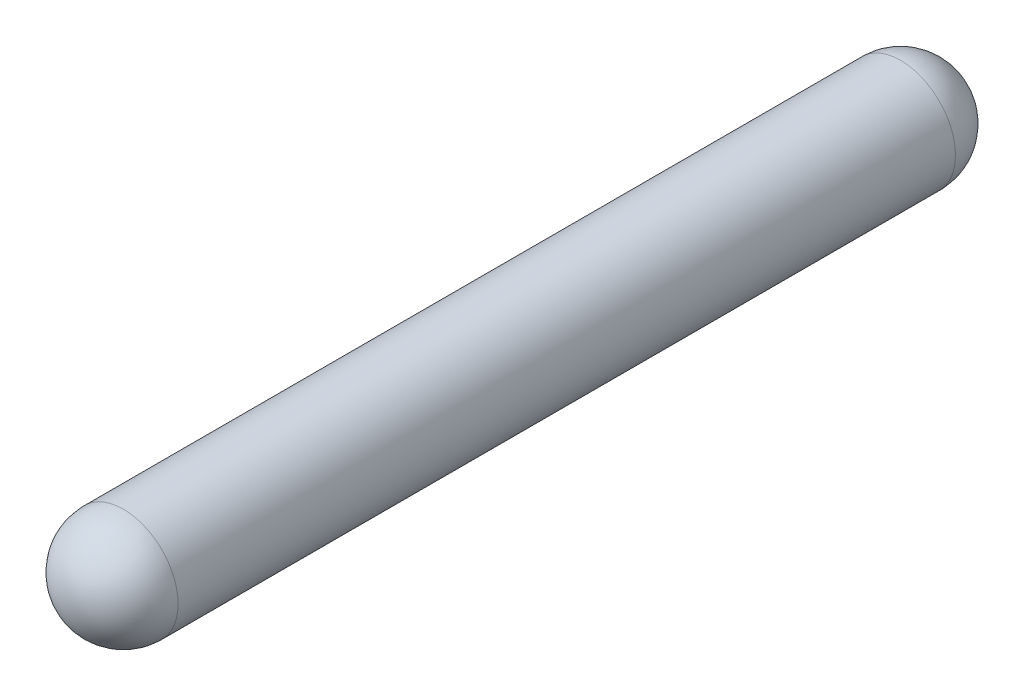
ISO-10303-21;
HEADER;
FILE_DESCRIPTION(('STEP AP214'),'2;1');
FILE_NAME('part.step','',(''),(''),'','','');
FILE_SCHEMA(('AUTOMOTIVE_DESIGN { 1 0 10303 214 1 1 1 1 }'));
ENDSEC;
DATA;
#1=APPLICATION_CONTEXT('core data for automotive mechanical design processes');
#2=APPLICATION_PROTOCOL_DEFINITION('international standard','automotive_design',2000,#1);
#3=PRODUCT_CONTEXT('',#1,'mechanical');
#4=PRODUCT('Part','Part','',(#3));
#5=PRODUCT_RELATED_PRODUCT_CATEGORY('part','',(#4));
#6=PRODUCT_DEFINITION_FORMATION('','',#4);
#7=PRODUCT_DEFINITION_CONTEXT('part definition',#1,'design');
#8=PRODUCT_DEFINITION('design','',#6,#7);
#9=PRODUCT_DEFINITION_SHAPE('','',#8);
#10=(LENGTH_UNIT() NAMED_UNIT(*) SI_UNIT(.MILLI.,.METRE.));
#11=(NAMED_UNIT(*) PLANE_ANGLE_UNIT() SI_UNIT($,.RADIAN.));
#12=(NAMED_UNIT(*) SI_UNIT($,.STERADIAN.) SOLID_ANGLE_UNIT());
#13=UNCERTAINTY_MEASURE_WITH_UNIT(LENGTH_MEASURE(1.E-05),#10,'distance_accuracy_value','');
#14=(GEOMETRIC_REPRESENTATION_CONTEXT(3) GLOBAL_UNCERTAINTY_ASSIGNED_CONTEXT((#13)) GLOBAL_UNIT_ASSIGNED_CONTEXT((#10,
#11,#12)) REPRESENTATION_CONTEXT('',''));
#15=CARTESIAN_POINT('',(0.,0.,0.));
#16=DIRECTION('',(0.,0.,1.));
#17=DIRECTION('',(1.,0.,0.));
#18=AXIS2_PLACEMENT_3D('',#15,#16,#17);
#19=CARTESIAN_POINT('',(0.,-2.54,-3.));
#20=DIRECTION('',(1.,0.,0.));
#21=DIRECTION('',(0.,-1.,0.));
#22=AXIS2_PLACEMENT_3D('',#19,#20,#21);
#23=SPHERICAL_SURFACE('',#22,0.458);
#24=CARTESIAN_POINT('',(0.,-2.54,-3.));
#25=DIRECTION('',(0.,0.,1.));
#26=DIRECTION('',(1.,0.,0.));
#27=AXIS2_PLACEMENT_3D('',#24,#25,#26);
#28=CIRCLE('',#27,0.458);
#29=CARTESIAN_POINT('',(0.458,-2.54,-3.));
#30=VERTEX_POINT('',#29);
#31=CARTESIAN_POINT('',(-0.458,-2.54,-3.));
#32=VERTEX_POINT('',#31);
#33=EDGE_CURVE('E42',#30,#32,#28,.T.);
#34=ORIENTED_EDGE('',*,*,#33,.F.);
#35=CARTESIAN_POINT('',(0.,-2.54,-3.));
#36=DIRECTION('',(0.,0.,1.));
#37=DIRECTION('',(1.,0.,0.));
#38=AXIS2_PLACEMENT_3D('',#35,#36,#37);
#39=CIRCLE('',#38,0.458);
#40=EDGE_CURVE('E26',#32,#30,#39,.T.);
#41=ORIENTED_EDGE('',*,*,#40,.F.);
#42=EDGE_LOOP('',(#34,#41));
#43=FACE_BOUND('',#42,.T.);
#44=ADVANCED_FACE('F17',(#43),#23,.T.);
#45=CARTESIAN_POINT('',(0.,-2.54,3.5));
#46=DIRECTION('',(1.,0.,0.));
#47=DIRECTION('',(0.,1.,0.));
#48=AXIS2_PLACEMENT_3D('',#45,#46,#47);
#49=SPHERICAL_SURFACE('',#48,0.458);
#50=CARTESIAN_POINT('',(0.,-2.54,3.5));
#51=DIRECTION('',(0.,0.,1.));
#52=DIRECTION('',(1.,0.,0.));
#53=AXIS2_PLACEMENT_3D('',#50,#51,#52);
#54=CIRCLE('',#53,0.458);
#55=CARTESIAN_POINT('',(0.458,-2.54,3.5));
#56=VERTEX_POINT('',#55);
#57=CARTESIAN_POINT('',(-0.458,-2.54,3.5));
#58=VERTEX_POINT('',#57);
#59=EDGE_CURVE('E11',#56,#58,#54,.F.);
#60=ORIENTED_EDGE('',*,*,#59,.F.);
#61=CARTESIAN_POINT('',(0.,-2.54,3.5));
#62=DIRECTION('',(0.,0.,1.));
#63=DIRECTION('',(1.,0.,0.));
#64=AXIS2_PLACEMENT_3D('',#61,#62,#63);
#65=CIRCLE('',#64,0.458);
#66=EDGE_CURVE('E34',#58,#56,#65,.F.);
#67=ORIENTED_EDGE('',*,*,#66,.F.);
#68=EDGE_LOOP('',(#60,#67));
#69=FACE_BOUND('',#68,.T.);
#70=ADVANCED_FACE('F49',(#69),#49,.T.);
#71=CARTESIAN_POINT('',(0.,-2.54,-3.));
#72=DIRECTION('',(0.,0.,1.));
#73=DIRECTION('',(1.,0.,0.));
#74=AXIS2_PLACEMENT_3D('',#71,#72,#73);
#75=CYLINDRICAL_SURFACE('',#74,0.458);
#76=ORIENTED_EDGE('',*,*,#66,.T.);
#77=ORIENTED_EDGE('',*,*,#59,.T.);
#78=EDGE_LOOP('',(#76,#77));
#79=FACE_BOUND('',#78,.T.);
#80=ORIENTED_EDGE('',*,*,#40,.T.);
#81=ORIENTED_EDGE('',*,*,#33,.T.);
#82=EDGE_LOOP('',(#80,#81));
#83=FACE_BOUND('',#82,.T.);
#84=ADVANCED_FACE('F45',(#79,#83),#75,.T.);
#85=CLOSED_SHELL('',(#44,#70,#84));
#86=MANIFOLD_SOLID_BREP('B1',#85);
#87=ADVANCED_BREP_SHAPE_REPRESENTATION('',(#18,#86),#14);
#88=SHAPE_DEFINITION_REPRESENTATION(#9,#87);
ENDSEC;
END-ISO-10303-21;
